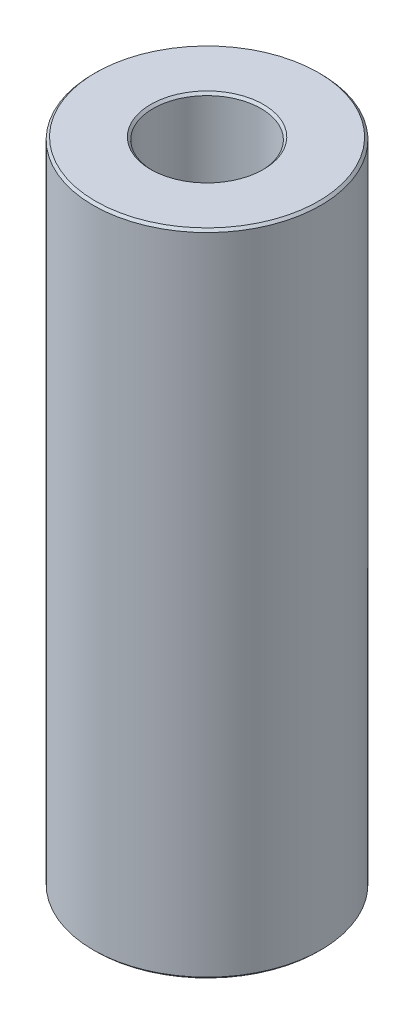
ISO-10303-21;
HEADER;
FILE_DESCRIPTION(('STEP AP214'),'2;1');
FILE_NAME('part.step','',(''),(''),'','','');
FILE_SCHEMA(('AUTOMOTIVE_DESIGN { 1 0 10303 214 1 1 1 1 }'));
ENDSEC;
DATA;
#1=APPLICATION_CONTEXT('core data for automotive mechanical design processes');
#2=APPLICATION_PROTOCOL_DEFINITION('international standard','automotive_design',2000,#1);
#3=PRODUCT_CONTEXT('',#1,'mechanical');
#4=PRODUCT('Part','Part','',(#3));
#5=PRODUCT_RELATED_PRODUCT_CATEGORY('part','',(#4));
#6=PRODUCT_DEFINITION_FORMATION('','',#4);
#7=PRODUCT_DEFINITION_CONTEXT('part definition',#1,'design');
#8=PRODUCT_DEFINITION('design','',#6,#7);
#9=PRODUCT_DEFINITION_SHAPE('','',#8);
#10=(LENGTH_UNIT() NAMED_UNIT(*) SI_UNIT(.MILLI.,.METRE.));
#11=(NAMED_UNIT(*) PLANE_ANGLE_UNIT() SI_UNIT($,.RADIAN.));
#12=(NAMED_UNIT(*) SI_UNIT($,.STERADIAN.) SOLID_ANGLE_UNIT());
#13=UNCERTAINTY_MEASURE_WITH_UNIT(LENGTH_MEASURE(1.E-05),#10,'distance_accuracy_value','');
#14=(GEOMETRIC_REPRESENTATION_CONTEXT(3) GLOBAL_UNCERTAINTY_ASSIGNED_CONTEXT((#13)) GLOBAL_UNIT_ASSIGNED_CONTEXT((#10,
#11,#12)) REPRESENTATION_CONTEXT('',''));
#15=CARTESIAN_POINT('',(0.,0.,0.));
#16=DIRECTION('',(0.,0.,1.));
#17=DIRECTION('',(1.,0.,0.));
#18=AXIS2_PLACEMENT_3D('',#15,#16,#17);
#19=CARTESIAN_POINT('',(0.,285.437479086694,0.));
#20=DIRECTION('',(0.,-1.,0.));
#21=DIRECTION('',(0.,0.,-1.));
#22=AXIS2_PLACEMENT_3D('',#19,#20,#21);
#23=CYLINDRICAL_SURFACE('',#22,50.);
#24=CARTESIAN_POINT('',(0.,1.04227808192126,0.));
#25=DIRECTION('',(0.,1.,0.));
#26=DIRECTION('',(0.,0.,1.));
#27=AXIS2_PLACEMENT_3D('',#24,#25,#26);
#28=CIRCLE('',#27,50.);
#29=CARTESIAN_POINT('',(0.,1.04227808192126,50.));
#30=VERTEX_POINT('',#29);
#31=EDGE_CURVE('E10',#30,#30,#28,.T.);
#32=ORIENTED_EDGE('',*,*,#31,.T.);
#33=EDGE_LOOP('',(#32));
#34=FACE_BOUND('',#33,.T.);
#35=CARTESIAN_POINT('',(0.,284.395201004772,0.));
#36=DIRECTION('',(0.,1.,0.));
#37=DIRECTION('',(0.,0.,1.));
#38=AXIS2_PLACEMENT_3D('',#35,#36,#37);
#39=CIRCLE('',#38,50.);
#40=CARTESIAN_POINT('',(0.,284.395201004772,50.));
#41=VERTEX_POINT('',#40);
#42=EDGE_CURVE('E50',#41,#41,#39,.F.);
#43=ORIENTED_EDGE('',*,*,#42,.T.);
#44=EDGE_LOOP('',(#43));
#45=FACE_BOUND('',#44,.T.);
#46=ADVANCED_FACE('F39',(#34,#45),#23,.T.);
#47=CARTESIAN_POINT('',(0.,285.437479086694,0.));
#48=DIRECTION('',(0.,1.,0.));
#49=DIRECTION('',(0.,0.,1.));
#50=AXIS2_PLACEMENT_3D('',#47,#48,#49);
#51=PLANE('',#50);
#52=CARTESIAN_POINT('',(0.,285.437479086694,0.));
#53=DIRECTION('',(0.,1.,0.));
#54=DIRECTION('',(0.,0.,1.));
#55=AXIS2_PLACEMENT_3D('',#52,#53,#54);
#56=CIRCLE('',#55,24.7793078627889);
#57=CARTESIAN_POINT('',(0.,285.437479086694,24.7793078627889));
#58=VERTEX_POINT('',#57);
#59=EDGE_CURVE('E58',#58,#58,#56,.F.);
#60=ORIENTED_EDGE('',*,*,#59,.T.);
#61=EDGE_LOOP('',(#60));
#62=FACE_BOUND('',#61,.T.);
#63=CARTESIAN_POINT('',(0.,285.437479086694,0.));
#64=DIRECTION('',(0.,1.,0.));
#65=DIRECTION('',(0.,0.,1.));
#66=AXIS2_PLACEMENT_3D('',#63,#64,#65);
#67=CIRCLE('',#66,48.9577219180788);
#68=CARTESIAN_POINT('',(0.,285.437479086694,48.9577219180788));
#69=VERTEX_POINT('',#68);
#70=EDGE_CURVE('E61',#69,#69,#67,.T.);
#71=ORIENTED_EDGE('',*,*,#70,.T.);
#72=EDGE_LOOP('',(#71));
#73=FACE_BOUND('',#72,.T.);
#74=ADVANCED_FACE('F88',(#62,#73),#51,.T.);
#75=CARTESIAN_POINT('',(0.,0.,0.));
#76=DIRECTION('',(0.,1.,0.));
#77=DIRECTION('',(0.,0.,1.));
#78=AXIS2_PLACEMENT_3D('',#75,#76,#77);
#79=PLANE('',#78);
#80=CARTESIAN_POINT('',(0.,0.,0.));
#81=DIRECTION('',(0.,1.,0.));
#82=DIRECTION('',(0.,0.,1.));
#83=AXIS2_PLACEMENT_3D('',#80,#81,#82);
#84=CIRCLE('',#83,24.7793078627889);
#85=CARTESIAN_POINT('',(0.,0.,24.7793078627889));
#86=VERTEX_POINT('',#85);
#87=EDGE_CURVE('E51',#86,#86,#84,.T.);
#88=ORIENTED_EDGE('',*,*,#87,.T.);
#89=EDGE_LOOP('',(#88));
#90=FACE_BOUND('',#89,.T.);
#91=CARTESIAN_POINT('',(0.,0.,0.));
#92=DIRECTION('',(0.,1.,0.));
#93=DIRECTION('',(0.,0.,1.));
#94=AXIS2_PLACEMENT_3D('',#91,#92,#93);
#95=CIRCLE('',#94,48.9577219180787);
#96=CARTESIAN_POINT('',(0.,0.,48.9577219180787));
#97=VERTEX_POINT('',#96);
#98=EDGE_CURVE('E54',#97,#97,#95,.F.);
#99=ORIENTED_EDGE('',*,*,#98,.T.);
#100=EDGE_LOOP('',(#99));
#101=FACE_BOUND('',#100,.T.);
#102=ADVANCED_FACE('F83',(#90,#101),#79,.F.);
#103=CARTESIAN_POINT('',(0.,285.437479086694,0.));
#104=DIRECTION('',(0.,-1.,0.));
#105=DIRECTION('',(0.,0.,-1.));
#106=AXIS2_PLACEMENT_3D('',#103,#104,#105);
#107=CYLINDRICAL_SURFACE('',#106,23.7370297808677);
#108=CARTESIAN_POINT('',(0.,284.395201004772,0.));
#109=DIRECTION('',(0.,1.,0.));
#110=DIRECTION('',(0.,0.,1.));
#111=AXIS2_PLACEMENT_3D('',#108,#109,#110);
#112=CIRCLE('',#111,23.7370297808677);
#113=CARTESIAN_POINT('',(0.,284.395201004772,23.7370297808677));
#114=VERTEX_POINT('',#113);
#115=EDGE_CURVE('E67',#114,#114,#112,.T.);
#116=ORIENTED_EDGE('',*,*,#115,.T.);
#117=EDGE_LOOP('',(#116));
#118=FACE_BOUND('',#117,.T.);
#119=CARTESIAN_POINT('',(0.,1.04227808192131,0.));
#120=DIRECTION('',(0.,1.,0.));
#121=DIRECTION('',(0.,0.,1.));
#122=AXIS2_PLACEMENT_3D('',#119,#120,#121);
#123=CIRCLE('',#122,23.7370297808677);
#124=CARTESIAN_POINT('',(0.,1.04227808192131,23.7370297808677));
#125=VERTEX_POINT('',#124);
#126=EDGE_CURVE('E69',#125,#125,#123,.F.);
#127=ORIENTED_EDGE('',*,*,#126,.T.);
#128=EDGE_LOOP('',(#127));
#129=FACE_BOUND('',#128,.T.);
#130=ADVANCED_FACE('F71',(#118,#129),#107,.F.);
#131=CARTESIAN_POINT('',(0.,284.395201004772,0.));
#132=DIRECTION('',(0.,1.,0.));
#133=DIRECTION('',(0.,0.,1.));
#134=AXIS2_PLACEMENT_3D('',#131,#132,#133);
#135=CONICAL_SURFACE('',#134,23.7370297808677,0.785398163397445);
#136=ORIENTED_EDGE('',*,*,#59,.F.);
#137=EDGE_LOOP('',(#136));
#138=FACE_BOUND('',#137,.T.);
#139=ORIENTED_EDGE('',*,*,#115,.F.);
#140=EDGE_LOOP('',(#139));
#141=FACE_BOUND('',#140,.T.);
#142=ADVANCED_FACE('F77',(#138,#141),#135,.F.);
#143=CARTESIAN_POINT('',(0.,0.,0.));
#144=DIRECTION('',(0.,-1.,0.));
#145=DIRECTION('',(0.,0.,-1.));
#146=AXIS2_PLACEMENT_3D('',#143,#144,#145);
#147=CONICAL_SURFACE('',#146,24.7793078627889,0.78539816339743);
#148=ORIENTED_EDGE('',*,*,#126,.F.);
#149=EDGE_LOOP('',(#148));
#150=FACE_BOUND('',#149,.T.);
#151=ORIENTED_EDGE('',*,*,#87,.F.);
#152=EDGE_LOOP('',(#151));
#153=FACE_BOUND('',#152,.T.);
#154=ADVANCED_FACE('F73',(#150,#153),#147,.F.);
#155=CARTESIAN_POINT('',(0.,1.04227808192126,0.));
#156=DIRECTION('',(0.,1.,0.));
#157=DIRECTION('',(0.,0.,1.));
#158=AXIS2_PLACEMENT_3D('',#155,#156,#157);
#159=CONICAL_SURFACE('',#158,50.,0.785398163397452);
#160=ORIENTED_EDGE('',*,*,#98,.F.);
#161=EDGE_LOOP('',(#160));
#162=FACE_BOUND('',#161,.T.);
#163=ORIENTED_EDGE('',*,*,#31,.F.);
#164=EDGE_LOOP('',(#163));
#165=FACE_BOUND('',#164,.T.);
#166=ADVANCED_FACE('F76',(#162,#165),#159,.T.);
#167=CARTESIAN_POINT('',(0.,285.437479086694,0.));
#168=DIRECTION('',(0.,-1.,0.));
#169=DIRECTION('',(0.,0.,-1.));
#170=AXIS2_PLACEMENT_3D('',#167,#168,#169);
#171=CONICAL_SURFACE('',#170,48.9577219180788,0.785398163397432);
#172=ORIENTED_EDGE('',*,*,#42,.F.);
#173=EDGE_LOOP('',(#172));
#174=FACE_BOUND('',#173,.T.);
#175=ORIENTED_EDGE('',*,*,#70,.F.);
#176=EDGE_LOOP('',(#175));
#177=FACE_BOUND('',#176,.T.);
#178=ADVANCED_FACE('F45',(#174,#177),#171,.T.);
#179=CLOSED_SHELL('',(#46,#74,#102,#130,#142,#154,#166,#178));
#180=MANIFOLD_SOLID_BREP('B2',#179);
#181=ADVANCED_BREP_SHAPE_REPRESENTATION('',(#18,#180),#14);
#182=SHAPE_DEFINITION_REPRESENTATION(#9,#181);
ENDSEC;
END-ISO-10303-21;
